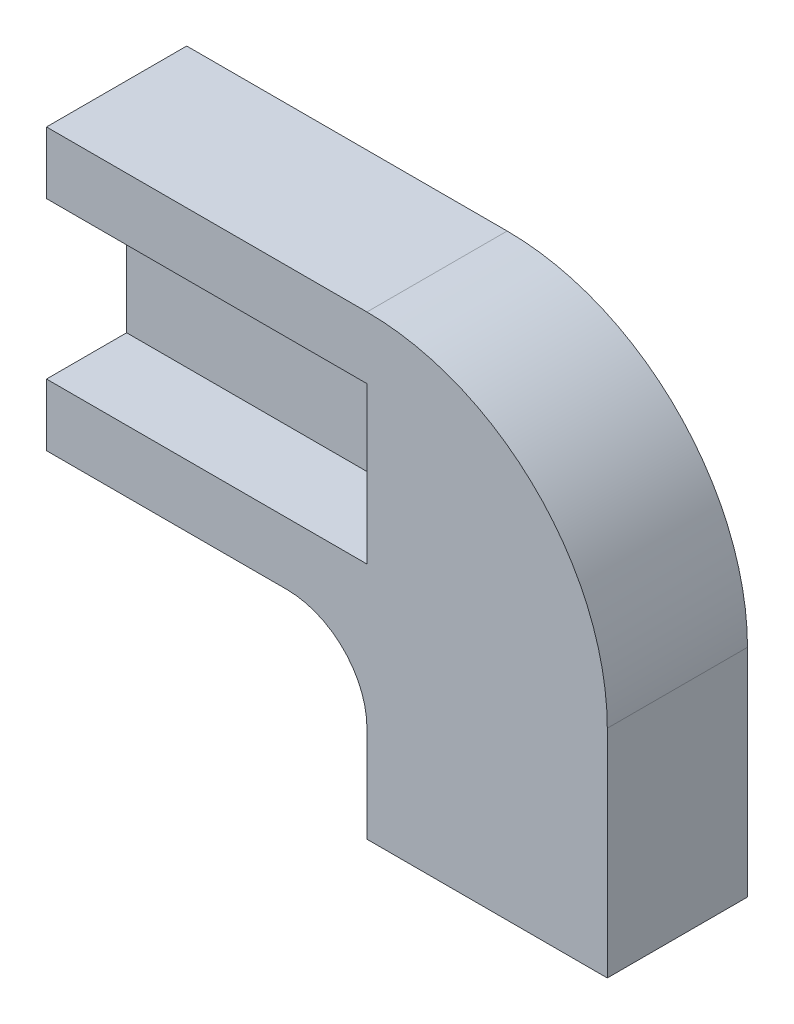
ISO-10303-21;
HEADER;
FILE_DESCRIPTION(('STEP AP214'),'2;1');
FILE_NAME('part.step','',(''),(''),'','','');
FILE_SCHEMA(('AUTOMOTIVE_DESIGN { 1 0 10303 214 1 1 1 1 }'));
ENDSEC;
DATA;
#1=APPLICATION_CONTEXT('core data for automotive mechanical design processes');
#2=APPLICATION_PROTOCOL_DEFINITION('international standard','automotive_design',2000,#1);
#3=PRODUCT_CONTEXT('',#1,'mechanical');
#4=PRODUCT('Part','Part','',(#3));
#5=PRODUCT_RELATED_PRODUCT_CATEGORY('part','',(#4));
#6=PRODUCT_DEFINITION_FORMATION('','',#4);
#7=PRODUCT_DEFINITION_CONTEXT('part definition',#1,'design');
#8=PRODUCT_DEFINITION('design','',#6,#7);
#9=PRODUCT_DEFINITION_SHAPE('','',#8);
#10=(LENGTH_UNIT() NAMED_UNIT(*) SI_UNIT(.MILLI.,.METRE.));
#11=(NAMED_UNIT(*) PLANE_ANGLE_UNIT() SI_UNIT($,.RADIAN.));
#12=(NAMED_UNIT(*) SI_UNIT($,.STERADIAN.) SOLID_ANGLE_UNIT());
#13=UNCERTAINTY_MEASURE_WITH_UNIT(LENGTH_MEASURE(1.E-05),#10,'distance_accuracy_value','');
#14=(GEOMETRIC_REPRESENTATION_CONTEXT(3) GLOBAL_UNCERTAINTY_ASSIGNED_CONTEXT((#13)) GLOBAL_UNIT_ASSIGNED_CONTEXT((#10,
#11,#12)) REPRESENTATION_CONTEXT('',''));
#15=CARTESIAN_POINT('',(0.,0.,0.));
#16=DIRECTION('',(0.,0.,1.));
#17=DIRECTION('',(1.,0.,0.));
#18=AXIS2_PLACEMENT_3D('',#15,#16,#17);
#19=CARTESIAN_POINT('',(0.,-8.89,4.445));
#20=DIRECTION('',(1.,0.,0.));
#21=DIRECTION('',(0.,0.,-1.));
#22=AXIS2_PLACEMENT_3D('',#19,#20,#21);
#23=PLANE('',#22);
#24=DIRECTION('',(0.,-1.,0.));
#25=VECTOR('',#24,1.);
#26=CARTESIAN_POINT('',(0.,-1.9685,1.905));
#27=LINE('',#26,#25);
#28=CARTESIAN_POINT('',(0.,-1.9685,1.905));
#29=VERTEX_POINT('',#28);
#30=CARTESIAN_POINT('',(0.,-6.9215,1.905));
#31=VERTEX_POINT('',#30);
#32=EDGE_CURVE('E133',#29,#31,#27,.T.);
#33=ORIENTED_EDGE('',*,*,#32,.F.);
#34=DIRECTION('',(0.,0.,1.));
#35=VECTOR('',#34,1.);
#36=CARTESIAN_POINT('',(0.,-1.9685,1.905));
#37=LINE('',#36,#35);
#38=CARTESIAN_POINT('',(0.,-1.9685,4.445));
#39=VERTEX_POINT('',#38);
#40=EDGE_CURVE('E172',#29,#39,#37,.T.);
#41=ORIENTED_EDGE('',*,*,#40,.T.);
#42=DIRECTION('',(0.,-1.,0.));
#43=VECTOR('',#42,1.);
#44=CARTESIAN_POINT('',(0.,-8.89,4.445));
#45=LINE('',#44,#43);
#46=CARTESIAN_POINT('',(0.,0.,4.445));
#47=VERTEX_POINT('',#46);
#48=EDGE_CURVE('E153',#47,#39,#45,.T.);
#49=ORIENTED_EDGE('',*,*,#48,.F.);
#50=DIRECTION('',(0.,0.,-1.));
#51=VECTOR('',#50,1.);
#52=CARTESIAN_POINT('',(0.,0.,4.445));
#53=LINE('',#52,#51);
#54=CARTESIAN_POINT('',(0.,0.,0.));
#55=VERTEX_POINT('',#54);
#56=EDGE_CURVE('E167',#47,#55,#53,.T.);
#57=ORIENTED_EDGE('',*,*,#56,.T.);
#58=DIRECTION('',(0.,-1.,0.));
#59=VECTOR('',#58,1.);
#60=CARTESIAN_POINT('',(0.,-8.89,0.));
#61=LINE('',#60,#59);
#62=CARTESIAN_POINT('',(0.,-8.89,0.));
#63=VERTEX_POINT('',#62);
#64=EDGE_CURVE('E168',#55,#63,#61,.T.);
#65=ORIENTED_EDGE('',*,*,#64,.T.);
#66=DIRECTION('',(0.,0.,-1.));
#67=VECTOR('',#66,1.);
#68=CARTESIAN_POINT('',(0.,-8.89,4.445));
#69=LINE('',#68,#67);
#70=CARTESIAN_POINT('',(0.,-8.89,4.445));
#71=VERTEX_POINT('',#70);
#72=EDGE_CURVE('E191',#71,#63,#69,.T.);
#73=ORIENTED_EDGE('',*,*,#72,.F.);
#74=CARTESIAN_POINT('',(0.,-6.9215,4.445));
#75=VERTEX_POINT('',#74);
#76=EDGE_CURVE('E146',#75,#71,#45,.T.);
#77=ORIENTED_EDGE('',*,*,#76,.F.);
#78=DIRECTION('',(0.,0.,1.));
#79=VECTOR('',#78,1.);
#80=CARTESIAN_POINT('',(0.,-6.9215,1.905));
#81=LINE('',#80,#79);
#82=EDGE_CURVE('E126',#31,#75,#81,.T.);
#83=ORIENTED_EDGE('',*,*,#82,.F.);
#84=EDGE_LOOP('',(#33,#41,#49,#57,#65,#73,#77,#83));
#85=FACE_BOUND('',#84,.T.);
#86=ADVANCED_FACE('F33',(#85),#23,.F.);
#87=CARTESIAN_POINT('',(10.16,-8.89,4.445));
#88=DIRECTION('',(0.,1.,0.));
#89=DIRECTION('',(-1.,0.,0.));
#90=AXIS2_PLACEMENT_3D('',#87,#88,#89);
#91=PLANE('',#90);
#92=DIRECTION('',(1.,0.,0.));
#93=VECTOR('',#92,1.);
#94=CARTESIAN_POINT('',(10.16,-8.89,0.));
#95=LINE('',#94,#93);
#96=CARTESIAN_POINT('',(7.62,-8.89,0.));
#97=VERTEX_POINT('',#96);
#98=EDGE_CURVE('E171',#63,#97,#95,.T.);
#99=ORIENTED_EDGE('',*,*,#98,.T.);
#100=DIRECTION('',(0.,0.,-1.));
#101=VECTOR('',#100,1.);
#102=CARTESIAN_POINT('',(7.62,-8.89,4.445));
#103=LINE('',#102,#101);
#104=CARTESIAN_POINT('',(7.62,-8.89,4.445));
#105=VERTEX_POINT('',#104);
#106=EDGE_CURVE('E197',#97,#105,#103,.F.);
#107=ORIENTED_EDGE('',*,*,#106,.T.);
#108=DIRECTION('',(1.,0.,0.));
#109=VECTOR('',#108,1.);
#110=CARTESIAN_POINT('',(10.16,-8.89,4.445));
#111=LINE('',#110,#109);
#112=EDGE_CURVE('E156',#71,#105,#111,.T.);
#113=ORIENTED_EDGE('',*,*,#112,.F.);
#114=ORIENTED_EDGE('',*,*,#72,.T.);
#115=EDGE_LOOP('',(#99,#107,#113,#114));
#116=FACE_BOUND('',#115,.T.);
#117=ADVANCED_FACE('F227',(#116),#91,.F.);
#118=CARTESIAN_POINT('',(10.16,-14.478,4.445));
#119=DIRECTION('',(1.,0.,0.));
#120=DIRECTION('',(0.,0.,-1.));
#121=AXIS2_PLACEMENT_3D('',#118,#119,#120);
#122=PLANE('',#121);
#123=DIRECTION('',(0.,-1.,0.));
#124=VECTOR('',#123,1.);
#125=CARTESIAN_POINT('',(10.16,-14.478,4.445));
#126=LINE('',#125,#124);
#127=CARTESIAN_POINT('',(10.16,-11.43,4.445));
#128=VERTEX_POINT('',#127);
#129=CARTESIAN_POINT('',(10.16,-14.478,4.445));
#130=VERTEX_POINT('',#129);
#131=EDGE_CURVE('E159',#128,#130,#126,.T.);
#132=ORIENTED_EDGE('',*,*,#131,.F.);
#133=DIRECTION('',(0.,0.,-1.));
#134=VECTOR('',#133,1.);
#135=CARTESIAN_POINT('',(10.16,-11.43,0.));
#136=LINE('',#135,#134);
#137=CARTESIAN_POINT('',(10.16,-11.43,0.));
#138=VERTEX_POINT('',#137);
#139=EDGE_CURVE('E194',#128,#138,#136,.T.);
#140=ORIENTED_EDGE('',*,*,#139,.T.);
#141=DIRECTION('',(0.,-1.,0.));
#142=VECTOR('',#141,1.);
#143=CARTESIAN_POINT('',(10.16,-14.478,0.));
#144=LINE('',#143,#142);
#145=CARTESIAN_POINT('',(10.16,-14.478,0.));
#146=VERTEX_POINT('',#145);
#147=EDGE_CURVE('E175',#138,#146,#144,.T.);
#148=ORIENTED_EDGE('',*,*,#147,.T.);
#149=DIRECTION('',(0.,0.,-1.));
#150=VECTOR('',#149,1.);
#151=CARTESIAN_POINT('',(10.16,-14.478,4.445));
#152=LINE('',#151,#150);
#153=EDGE_CURVE('E188',#130,#146,#152,.T.);
#154=ORIENTED_EDGE('',*,*,#153,.F.);
#155=EDGE_LOOP('',(#132,#140,#148,#154));
#156=FACE_BOUND('',#155,.T.);
#157=ADVANCED_FACE('F232',(#156),#122,.F.);
#158=CARTESIAN_POINT('',(17.78,-14.478,4.445));
#159=DIRECTION('',(0.,1.,0.));
#160=DIRECTION('',(-1.,0.,0.));
#161=AXIS2_PLACEMENT_3D('',#158,#159,#160);
#162=PLANE('',#161);
#163=DIRECTION('',(1.,0.,0.));
#164=VECTOR('',#163,1.);
#165=CARTESIAN_POINT('',(17.78,-14.478,0.));
#166=LINE('',#165,#164);
#167=CARTESIAN_POINT('',(17.78,-14.478,0.));
#168=VERTEX_POINT('',#167);
#169=EDGE_CURVE('E177',#146,#168,#166,.T.);
#170=ORIENTED_EDGE('',*,*,#169,.T.);
#171=DIRECTION('',(0.,0.,-1.));
#172=VECTOR('',#171,1.);
#173=CARTESIAN_POINT('',(17.78,-14.478,4.445));
#174=LINE('',#173,#172);
#175=CARTESIAN_POINT('',(17.78,-14.478,4.445));
#176=VERTEX_POINT('',#175);
#177=EDGE_CURVE('E185',#176,#168,#174,.T.);
#178=ORIENTED_EDGE('',*,*,#177,.F.);
#179=DIRECTION('',(1.,0.,0.));
#180=VECTOR('',#179,1.);
#181=CARTESIAN_POINT('',(17.78,-14.478,4.445));
#182=LINE('',#181,#180);
#183=EDGE_CURVE('E161',#130,#176,#182,.T.);
#184=ORIENTED_EDGE('',*,*,#183,.F.);
#185=ORIENTED_EDGE('',*,*,#153,.T.);
#186=EDGE_LOOP('',(#170,#178,#184,#185));
#187=FACE_BOUND('',#186,.T.);
#188=ADVANCED_FACE('F238',(#187),#162,.F.);
#189=CARTESIAN_POINT('',(17.78,0.,4.445));
#190=DIRECTION('',(-1.,0.,0.));
#191=DIRECTION('',(0.,0.,1.));
#192=AXIS2_PLACEMENT_3D('',#189,#190,#191);
#193=PLANE('',#192);
#194=DIRECTION('',(0.,1.,0.));
#195=VECTOR('',#194,1.);
#196=CARTESIAN_POINT('',(17.78,0.,0.));
#197=LINE('',#196,#195);
#198=CARTESIAN_POINT('',(17.78,-7.62,0.));
#199=VERTEX_POINT('',#198);
#200=EDGE_CURVE('E179',#168,#199,#197,.T.);
#201=ORIENTED_EDGE('',*,*,#200,.T.);
#202=DIRECTION('',(0.,0.,-1.));
#203=VECTOR('',#202,1.);
#204=CARTESIAN_POINT('',(17.78,-7.62,4.445));
#205=LINE('',#204,#203);
#206=CARTESIAN_POINT('',(17.78,-7.62,4.445));
#207=VERTEX_POINT('',#206);
#208=EDGE_CURVE('E41',#199,#207,#205,.F.);
#209=ORIENTED_EDGE('',*,*,#208,.T.);
#210=DIRECTION('',(0.,1.,0.));
#211=VECTOR('',#210,1.);
#212=CARTESIAN_POINT('',(17.78,0.,4.445));
#213=LINE('',#212,#211);
#214=EDGE_CURVE('E163',#176,#207,#213,.T.);
#215=ORIENTED_EDGE('',*,*,#214,.F.);
#216=ORIENTED_EDGE('',*,*,#177,.T.);
#217=EDGE_LOOP('',(#201,#209,#215,#216));
#218=FACE_BOUND('',#217,.T.);
#219=ADVANCED_FACE('F242',(#218),#193,.F.);
#220=CARTESIAN_POINT('',(0.,0.,4.445));
#221=DIRECTION('',(0.,-1.,0.));
#222=DIRECTION('',(0.,0.,-1.));
#223=AXIS2_PLACEMENT_3D('',#220,#221,#222);
#224=PLANE('',#223);
#225=DIRECTION('',(-1.,0.,0.));
#226=VECTOR('',#225,1.);
#227=CARTESIAN_POINT('',(0.,0.,4.445));
#228=LINE('',#227,#226);
#229=CARTESIAN_POINT('',(10.16,0.,4.445));
#230=VERTEX_POINT('',#229);
#231=EDGE_CURVE('E165',#230,#47,#228,.T.);
#232=ORIENTED_EDGE('',*,*,#231,.F.);
#233=DIRECTION('',(0.,0.,-1.));
#234=VECTOR('',#233,1.);
#235=CARTESIAN_POINT('',(10.16,0.,4.445));
#236=LINE('',#235,#234);
#237=CARTESIAN_POINT('',(10.16,0.,0.));
#238=VERTEX_POINT('',#237);
#239=EDGE_CURVE('E203',#230,#238,#236,.T.);
#240=ORIENTED_EDGE('',*,*,#239,.T.);
#241=DIRECTION('',(-1.,0.,0.));
#242=VECTOR('',#241,1.);
#243=CARTESIAN_POINT('',(0.,0.,0.));
#244=LINE('',#243,#242);
#245=EDGE_CURVE('E181',#238,#55,#244,.T.);
#246=ORIENTED_EDGE('',*,*,#245,.T.);
#247=ORIENTED_EDGE('',*,*,#56,.F.);
#248=EDGE_LOOP('',(#232,#240,#246,#247));
#249=FACE_BOUND('',#248,.T.);
#250=ADVANCED_FACE('F209',(#249),#224,.F.);
#251=CARTESIAN_POINT('',(0.,0.,4.445));
#252=DIRECTION('',(0.,0.,-1.));
#253=DIRECTION('',(-1.,0.,0.));
#254=AXIS2_PLACEMENT_3D('',#251,#252,#253);
#255=PLANE('',#254);
#256=ORIENTED_EDGE('',*,*,#214,.T.);
#257=CARTESIAN_POINT('',(10.16,-7.62,4.445));
#258=DIRECTION('',(0.,0.,-1.));
#259=DIRECTION('',(-1.,0.,0.));
#260=AXIS2_PLACEMENT_3D('',#257,#258,#259);
#261=CIRCLE('',#260,7.62);
#262=EDGE_CURVE('E11',#207,#230,#261,.F.);
#263=ORIENTED_EDGE('',*,*,#262,.T.);
#264=ORIENTED_EDGE('',*,*,#231,.T.);
#265=ORIENTED_EDGE('',*,*,#48,.T.);
#266=DIRECTION('',(-1.,0.,0.));
#267=VECTOR('',#266,1.);
#268=CARTESIAN_POINT('',(10.16,-1.9685,4.445));
#269=LINE('',#268,#267);
#270=CARTESIAN_POINT('',(10.16,-1.9685,4.445));
#271=VERTEX_POINT('',#270);
#272=EDGE_CURVE('E142',#271,#39,#269,.T.);
#273=ORIENTED_EDGE('',*,*,#272,.F.);
#274=DIRECTION('',(0.,1.,0.));
#275=VECTOR('',#274,1.);
#276=CARTESIAN_POINT('',(10.16,-1.9685,4.445));
#277=LINE('',#276,#275);
#278=CARTESIAN_POINT('',(10.16,-6.9215,4.445));
#279=VERTEX_POINT('',#278);
#280=EDGE_CURVE('E344',#279,#271,#277,.T.);
#281=ORIENTED_EDGE('',*,*,#280,.F.);
#282=DIRECTION('',(1.,0.,0.));
#283=VECTOR('',#282,1.);
#284=CARTESIAN_POINT('',(10.16,-6.9215,4.445));
#285=LINE('',#284,#283);
#286=EDGE_CURVE('E346',#75,#279,#285,.T.);
#287=ORIENTED_EDGE('',*,*,#286,.F.);
#288=ORIENTED_EDGE('',*,*,#76,.T.);
#289=ORIENTED_EDGE('',*,*,#112,.T.);
#290=CARTESIAN_POINT('',(7.62,-11.43,4.445));
#291=DIRECTION('',(0.,0.,-1.));
#292=DIRECTION('',(-1.,0.,0.));
#293=AXIS2_PLACEMENT_3D('',#290,#291,#292);
#294=CIRCLE('',#293,2.54);
#295=EDGE_CURVE('E201',#105,#128,#294,.T.);
#296=ORIENTED_EDGE('',*,*,#295,.T.);
#297=ORIENTED_EDGE('',*,*,#131,.T.);
#298=ORIENTED_EDGE('',*,*,#183,.T.);
#299=EDGE_LOOP('',(#256,#263,#264,#265,#273,#281,#287,#288,#289,#296,#297,#298));
#300=FACE_BOUND('',#299,.T.);
#301=ADVANCED_FACE('F218',(#300),#255,.F.);
#302=CARTESIAN_POINT('',(0.,0.,0.));
#303=DIRECTION('',(0.,0.,-1.));
#304=DIRECTION('',(-1.,0.,0.));
#305=AXIS2_PLACEMENT_3D('',#302,#303,#304);
#306=PLANE('',#305);
#307=ORIENTED_EDGE('',*,*,#245,.F.);
#308=CARTESIAN_POINT('',(10.16,-7.62,0.));
#309=DIRECTION('',(0.,0.,-1.));
#310=DIRECTION('',(-1.,0.,0.));
#311=AXIS2_PLACEMENT_3D('',#308,#309,#310);
#312=CIRCLE('',#311,7.62);
#313=EDGE_CURVE('E55',#238,#199,#312,.T.);
#314=ORIENTED_EDGE('',*,*,#313,.T.);
#315=ORIENTED_EDGE('',*,*,#200,.F.);
#316=ORIENTED_EDGE('',*,*,#169,.F.);
#317=ORIENTED_EDGE('',*,*,#147,.F.);
#318=CARTESIAN_POINT('',(7.62,-11.43,0.));
#319=DIRECTION('',(0.,0.,-1.));
#320=DIRECTION('',(-1.,0.,0.));
#321=AXIS2_PLACEMENT_3D('',#318,#319,#320);
#322=CIRCLE('',#321,2.54);
#323=EDGE_CURVE('E199',#138,#97,#322,.F.);
#324=ORIENTED_EDGE('',*,*,#323,.T.);
#325=ORIENTED_EDGE('',*,*,#98,.F.);
#326=ORIENTED_EDGE('',*,*,#64,.F.);
#327=EDGE_LOOP('',(#307,#314,#315,#316,#317,#324,#325,#326));
#328=FACE_BOUND('',#327,.T.);
#329=ADVANCED_FACE('F214',(#328),#306,.T.);
#330=CARTESIAN_POINT('',(10.16,-1.9685,1.905));
#331=DIRECTION('',(0.,1.,0.));
#332=DIRECTION('',(-1.,0.,0.));
#333=AXIS2_PLACEMENT_3D('',#330,#331,#332);
#334=PLANE('',#333);
#335=ORIENTED_EDGE('',*,*,#272,.T.);
#336=ORIENTED_EDGE('',*,*,#40,.F.);
#337=DIRECTION('',(-1.,0.,0.));
#338=VECTOR('',#337,1.);
#339=CARTESIAN_POINT('',(10.16,-1.9685,1.905));
#340=LINE('',#339,#338);
#341=CARTESIAN_POINT('',(10.16,-1.9685,1.905));
#342=VERTEX_POINT('',#341);
#343=EDGE_CURVE('E139',#342,#29,#340,.T.);
#344=ORIENTED_EDGE('',*,*,#343,.F.);
#345=DIRECTION('',(0.,0.,1.));
#346=VECTOR('',#345,1.);
#347=CARTESIAN_POINT('',(10.16,-1.9685,1.905));
#348=LINE('',#347,#346);
#349=EDGE_CURVE('E148',#342,#271,#348,.T.);
#350=ORIENTED_EDGE('',*,*,#349,.T.);
#351=EDGE_LOOP('',(#335,#336,#344,#350));
#352=FACE_BOUND('',#351,.T.);
#353=ADVANCED_FACE('F250',(#352),#334,.F.);
#354=CARTESIAN_POINT('',(10.16,-1.9685,1.905));
#355=DIRECTION('',(1.,0.,0.));
#356=DIRECTION('',(0.,0.,-1.));
#357=AXIS2_PLACEMENT_3D('',#354,#355,#356);
#358=PLANE('',#357);
#359=ORIENTED_EDGE('',*,*,#280,.T.);
#360=ORIENTED_EDGE('',*,*,#349,.F.);
#361=DIRECTION('',(0.,1.,0.));
#362=VECTOR('',#361,1.);
#363=CARTESIAN_POINT('',(10.16,-1.9685,1.905));
#364=LINE('',#363,#362);
#365=CARTESIAN_POINT('',(10.16,-6.9215,1.905));
#366=VERTEX_POINT('',#365);
#367=EDGE_CURVE('E132',#366,#342,#364,.T.);
#368=ORIENTED_EDGE('',*,*,#367,.F.);
#369=DIRECTION('',(0.,0.,1.));
#370=VECTOR('',#369,1.);
#371=CARTESIAN_POINT('',(10.16,-6.9215,1.905));
#372=LINE('',#371,#370);
#373=EDGE_CURVE('E128',#366,#279,#372,.T.);
#374=ORIENTED_EDGE('',*,*,#373,.T.);
#375=EDGE_LOOP('',(#359,#360,#368,#374));
#376=FACE_BOUND('',#375,.T.);
#377=ADVANCED_FACE('F255',(#376),#358,.F.);
#378=CARTESIAN_POINT('',(10.16,-6.9215,1.905));
#379=DIRECTION('',(0.,-1.,0.));
#380=DIRECTION('',(1.,0.,0.));
#381=AXIS2_PLACEMENT_3D('',#378,#379,#380);
#382=PLANE('',#381);
#383=ORIENTED_EDGE('',*,*,#286,.T.);
#384=ORIENTED_EDGE('',*,*,#373,.F.);
#385=DIRECTION('',(1.,0.,0.));
#386=VECTOR('',#385,1.);
#387=CARTESIAN_POINT('',(10.16,-6.9215,1.905));
#388=LINE('',#387,#386);
#389=EDGE_CURVE('E121',#31,#366,#388,.T.);
#390=ORIENTED_EDGE('',*,*,#389,.F.);
#391=ORIENTED_EDGE('',*,*,#82,.T.);
#392=EDGE_LOOP('',(#383,#384,#390,#391));
#393=FACE_BOUND('',#392,.T.);
#394=ADVANCED_FACE('F124',(#393),#382,.F.);
#395=CARTESIAN_POINT('',(0.,0.,1.905));
#396=DIRECTION('',(0.,0.,-1.));
#397=DIRECTION('',(-1.,0.,0.));
#398=AXIS2_PLACEMENT_3D('',#395,#396,#397);
#399=PLANE('',#398);
#400=ORIENTED_EDGE('',*,*,#32,.T.);
#401=ORIENTED_EDGE('',*,*,#389,.T.);
#402=ORIENTED_EDGE('',*,*,#367,.T.);
#403=ORIENTED_EDGE('',*,*,#343,.T.);
#404=EDGE_LOOP('',(#400,#401,#402,#403));
#405=FACE_BOUND('',#404,.T.);
#406=ADVANCED_FACE('F137',(#405),#399,.F.);
#407=CARTESIAN_POINT('',(7.62,-11.43,4.445));
#408=DIRECTION('',(0.,0.,1.));
#409=DIRECTION('',(1.,0.,0.));
#410=AXIS2_PLACEMENT_3D('',#407,#408,#409);
#411=CYLINDRICAL_SURFACE('',#410,2.54);
#412=ORIENTED_EDGE('',*,*,#295,.F.);
#413=ORIENTED_EDGE('',*,*,#106,.F.);
#414=ORIENTED_EDGE('',*,*,#323,.F.);
#415=ORIENTED_EDGE('',*,*,#139,.F.);
#416=EDGE_LOOP('',(#412,#413,#414,#415));
#417=FACE_BOUND('',#416,.T.);
#418=ADVANCED_FACE('F221',(#417),#411,.F.);
#419=CARTESIAN_POINT('',(10.16,-7.62,4.445));
#420=DIRECTION('',(0.,0.,-1.));
#421=DIRECTION('',(-1.,0.,0.));
#422=AXIS2_PLACEMENT_3D('',#419,#420,#421);
#423=CYLINDRICAL_SURFACE('',#422,7.62);
#424=ORIENTED_EDGE('',*,*,#262,.F.);
#425=ORIENTED_EDGE('',*,*,#208,.F.);
#426=ORIENTED_EDGE('',*,*,#313,.F.);
#427=ORIENTED_EDGE('',*,*,#239,.F.);
#428=EDGE_LOOP('',(#424,#425,#426,#427));
#429=FACE_BOUND('',#428,.T.);
#430=ADVANCED_FACE('F35',(#429),#423,.T.);
#431=CLOSED_SHELL('',(#86,#117,#157,#188,#219,#250,#301,#329,#353,#377,#394,#406,#418,#430));
#432=MANIFOLD_SOLID_BREP('B2',#431);
#433=ADVANCED_BREP_SHAPE_REPRESENTATION('',(#18,#432),#14);
#434=SHAPE_DEFINITION_REPRESENTATION(#9,#433);
ENDSEC;
END-ISO-10303-21;
